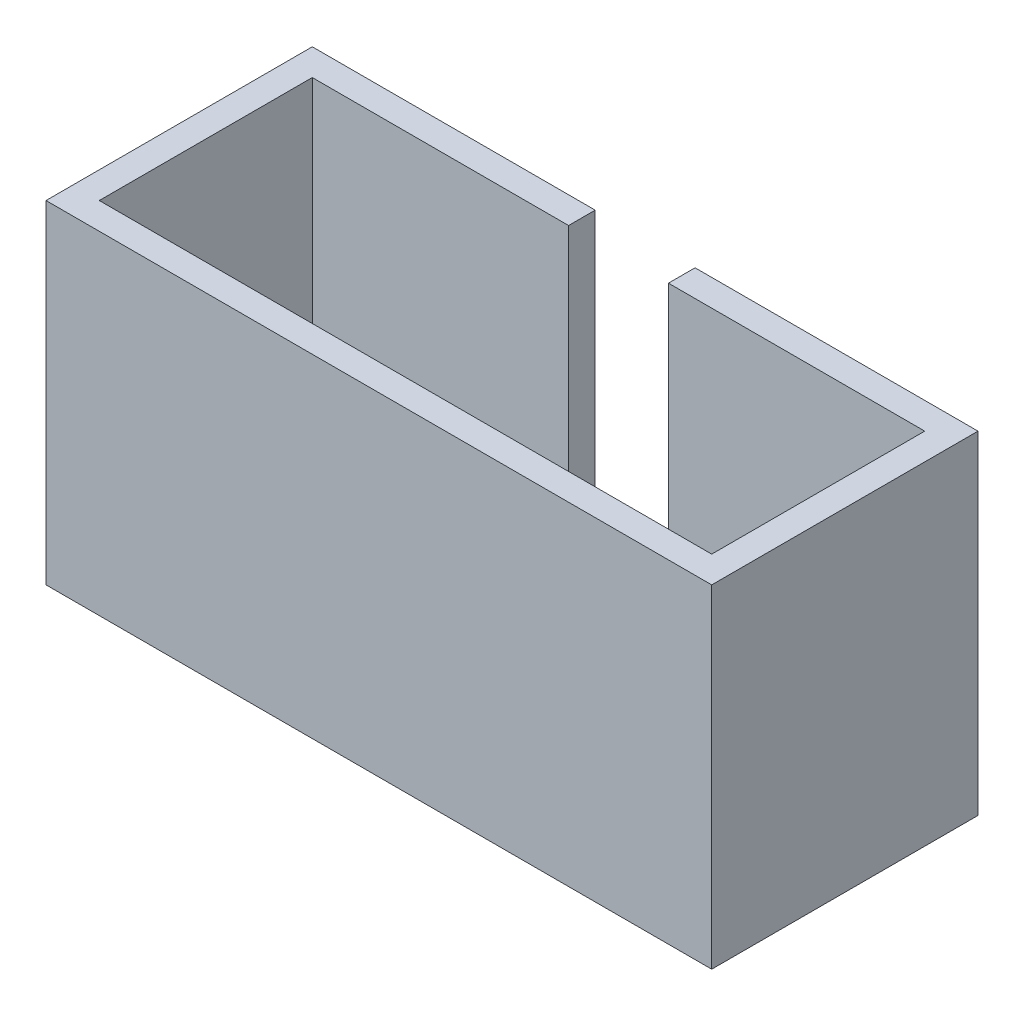
ISO-10303-21;
HEADER;
FILE_DESCRIPTION(('STEP AP214'),'2;1');
FILE_NAME('part.step','',(''),(''),'','','');
FILE_SCHEMA(('AUTOMOTIVE_DESIGN { 1 0 10303 214 1 1 1 1 }'));
ENDSEC;
DATA;
#1=APPLICATION_CONTEXT('core data for automotive mechanical design processes');
#2=APPLICATION_PROTOCOL_DEFINITION('international standard','automotive_design',2000,#1);
#3=PRODUCT_CONTEXT('',#1,'mechanical');
#4=PRODUCT('Part','Part','',(#3));
#5=PRODUCT_RELATED_PRODUCT_CATEGORY('part','',(#4));
#6=PRODUCT_DEFINITION_FORMATION('','',#4);
#7=PRODUCT_DEFINITION_CONTEXT('part definition',#1,'design');
#8=PRODUCT_DEFINITION('design','',#6,#7);
#9=PRODUCT_DEFINITION_SHAPE('','',#8);
#10=(LENGTH_UNIT() NAMED_UNIT(*) SI_UNIT(.MILLI.,.METRE.));
#11=(NAMED_UNIT(*) PLANE_ANGLE_UNIT() SI_UNIT($,.RADIAN.));
#12=(NAMED_UNIT(*) SI_UNIT($,.STERADIAN.) SOLID_ANGLE_UNIT());
#13=UNCERTAINTY_MEASURE_WITH_UNIT(LENGTH_MEASURE(1.E-05),#10,'distance_accuracy_value','');
#14=(GEOMETRIC_REPRESENTATION_CONTEXT(3) GLOBAL_UNCERTAINTY_ASSIGNED_CONTEXT((#13)) GLOBAL_UNIT_ASSIGNED_CONTEXT((#10,
#11,#12)) REPRESENTATION_CONTEXT('',''));
#15=CARTESIAN_POINT('',(0.,0.,0.));
#16=DIRECTION('',(0.,0.,1.));
#17=DIRECTION('',(1.,0.,0.));
#18=AXIS2_PLACEMENT_3D('',#15,#16,#17);
#19=CARTESIAN_POINT('',(0.,10.,0.));
#20=DIRECTION('',(0.,1.,0.));
#21=DIRECTION('',(0.,0.,1.));
#22=AXIS2_PLACEMENT_3D('',#19,#20,#21);
#23=PLANE('',#22);
#24=DIRECTION('',(-1.,0.,0.));
#25=VECTOR('',#24,1.);
#26=CARTESIAN_POINT('',(-10.,10.,-4.));
#27=LINE('',#26,#25);
#28=CARTESIAN_POINT('',(10.,10.,-4.));
#29=VERTEX_POINT('',#28);
#30=CARTESIAN_POINT('',(1.5,10.,-4.));
#31=VERTEX_POINT('',#30);
#32=EDGE_CURVE('E193',#29,#31,#27,.T.);
#33=ORIENTED_EDGE('',*,*,#32,.T.);
#34=DIRECTION('',(0.,0.,-1.));
#35=VECTOR('',#34,1.);
#36=CARTESIAN_POINT('',(1.5,10.,4.001));
#37=LINE('',#36,#35);
#38=CARTESIAN_POINT('',(1.5,10.,-3.2));
#39=VERTEX_POINT('',#38);
#40=EDGE_CURVE('E152',#39,#31,#37,.T.);
#41=ORIENTED_EDGE('',*,*,#40,.F.);
#42=DIRECTION('',(-1.,0.,0.));
#43=VECTOR('',#42,1.);
#44=CARTESIAN_POINT('',(-9.2,10.,-3.2));
#45=LINE('',#44,#43);
#46=CARTESIAN_POINT('',(9.2,10.,-3.2));
#47=VERTEX_POINT('',#46);
#48=EDGE_CURVE('E167',#47,#39,#45,.T.);
#49=ORIENTED_EDGE('',*,*,#48,.F.);
#50=DIRECTION('',(0.,0.,-1.));
#51=VECTOR('',#50,1.);
#52=CARTESIAN_POINT('',(9.2,10.,3.2));
#53=LINE('',#52,#51);
#54=CARTESIAN_POINT('',(9.2,10.,3.2));
#55=VERTEX_POINT('',#54);
#56=EDGE_CURVE('E164',#55,#47,#53,.T.);
#57=ORIENTED_EDGE('',*,*,#56,.F.);
#58=DIRECTION('',(1.,0.,0.));
#59=VECTOR('',#58,1.);
#60=CARTESIAN_POINT('',(-9.2,10.,3.2));
#61=LINE('',#60,#59);
#62=CARTESIAN_POINT('',(-9.2,10.,3.2));
#63=VERTEX_POINT('',#62);
#64=EDGE_CURVE('E172',#63,#55,#61,.T.);
#65=ORIENTED_EDGE('',*,*,#64,.F.);
#66=DIRECTION('',(0.,0.,1.));
#67=VECTOR('',#66,1.);
#68=CARTESIAN_POINT('',(-9.2,10.,3.2));
#69=LINE('',#68,#67);
#70=CARTESIAN_POINT('',(-9.2,10.,-3.2));
#71=VERTEX_POINT('',#70);
#72=EDGE_CURVE('E169',#71,#63,#69,.T.);
#73=ORIENTED_EDGE('',*,*,#72,.F.);
#74=CARTESIAN_POINT('',(-1.5,10.,-3.2));
#75=VERTEX_POINT('',#74);
#76=EDGE_CURVE('E166',#75,#71,#45,.T.);
#77=ORIENTED_EDGE('',*,*,#76,.F.);
#78=DIRECTION('',(0.,0.,-1.));
#79=VECTOR('',#78,1.);
#80=CARTESIAN_POINT('',(-1.5,10.,4.001));
#81=LINE('',#80,#79);
#82=CARTESIAN_POINT('',(-1.5,10.,-4.));
#83=VERTEX_POINT('',#82);
#84=EDGE_CURVE('E47',#75,#83,#81,.T.);
#85=ORIENTED_EDGE('',*,*,#84,.T.);
#86=CARTESIAN_POINT('',(-10.,10.,-4.));
#87=VERTEX_POINT('',#86);
#88=EDGE_CURVE('E192',#83,#87,#27,.T.);
#89=ORIENTED_EDGE('',*,*,#88,.T.);
#90=DIRECTION('',(0.,0.,1.));
#91=VECTOR('',#90,1.);
#92=CARTESIAN_POINT('',(-10.,10.,-4.));
#93=LINE('',#92,#91);
#94=CARTESIAN_POINT('',(-10.,10.,4.));
#95=VERTEX_POINT('',#94);
#96=EDGE_CURVE('E184',#87,#95,#93,.T.);
#97=ORIENTED_EDGE('',*,*,#96,.T.);
#98=DIRECTION('',(1.,0.,0.));
#99=VECTOR('',#98,1.);
#100=CARTESIAN_POINT('',(-10.,10.,4.));
#101=LINE('',#100,#99);
#102=CARTESIAN_POINT('',(10.,10.,4.));
#103=VERTEX_POINT('',#102);
#104=EDGE_CURVE('E187',#95,#103,#101,.T.);
#105=ORIENTED_EDGE('',*,*,#104,.T.);
#106=DIRECTION('',(0.,0.,-1.));
#107=VECTOR('',#106,1.);
#108=CARTESIAN_POINT('',(10.,10.,-4.));
#109=LINE('',#108,#107);
#110=EDGE_CURVE('E190',#103,#29,#109,.T.);
#111=ORIENTED_EDGE('',*,*,#110,.T.);
#112=EDGE_LOOP('',(#33,#41,#49,#57,#65,#73,#77,#85,#89,#97,#105,#111));
#113=FACE_BOUND('',#112,.T.);
#114=ADVANCED_FACE('F32',(#113),#23,.T.);
#115=CARTESIAN_POINT('',(-10.,10.,-4.));
#116=DIRECTION('',(0.,0.,1.));
#117=DIRECTION('',(1.,0.,0.));
#118=AXIS2_PLACEMENT_3D('',#115,#116,#117);
#119=PLANE('',#118);
#120=DIRECTION('',(0.,1.,0.));
#121=VECTOR('',#120,1.);
#122=CARTESIAN_POINT('',(1.5,2.,-4.));
#123=LINE('',#122,#121);
#124=CARTESIAN_POINT('',(1.5,2.,-4.));
#125=VERTEX_POINT('',#124);
#126=EDGE_CURVE('E147',#125,#31,#123,.T.);
#127=ORIENTED_EDGE('',*,*,#126,.T.);
#128=ORIENTED_EDGE('',*,*,#32,.F.);
#129=DIRECTION('',(0.,-1.,0.));
#130=VECTOR('',#129,1.);
#131=CARTESIAN_POINT('',(10.,10.,-4.));
#132=LINE('',#131,#130);
#133=CARTESIAN_POINT('',(10.,0.,-4.));
#134=VERTEX_POINT('',#133);
#135=EDGE_CURVE('E206',#29,#134,#132,.T.);
#136=ORIENTED_EDGE('',*,*,#135,.T.);
#137=DIRECTION('',(-1.,0.,0.));
#138=VECTOR('',#137,1.);
#139=CARTESIAN_POINT('',(-10.,0.,-4.));
#140=LINE('',#139,#138);
#141=CARTESIAN_POINT('',(-10.,0.,-4.));
#142=VERTEX_POINT('',#141);
#143=EDGE_CURVE('E188',#134,#142,#140,.T.);
#144=ORIENTED_EDGE('',*,*,#143,.T.);
#145=DIRECTION('',(0.,-1.,0.));
#146=VECTOR('',#145,1.);
#147=CARTESIAN_POINT('',(-10.,10.,-4.));
#148=LINE('',#147,#146);
#149=EDGE_CURVE('E196',#87,#142,#148,.T.);
#150=ORIENTED_EDGE('',*,*,#149,.F.);
#151=ORIENTED_EDGE('',*,*,#88,.F.);
#152=DIRECTION('',(0.,-1.,0.));
#153=VECTOR('',#152,1.);
#154=CARTESIAN_POINT('',(-1.5,2.,-4.));
#155=LINE('',#154,#153);
#156=CARTESIAN_POINT('',(-1.5,2.,-4.));
#157=VERTEX_POINT('',#156);
#158=EDGE_CURVE('E132',#83,#157,#155,.T.);
#159=ORIENTED_EDGE('',*,*,#158,.T.);
#160=DIRECTION('',(1.,0.,0.));
#161=VECTOR('',#160,1.);
#162=CARTESIAN_POINT('',(-1.5,2.,-4.));
#163=LINE('',#162,#161);
#164=EDGE_CURVE('E130',#157,#125,#163,.T.);
#165=ORIENTED_EDGE('',*,*,#164,.T.);
#166=EDGE_LOOP('',(#127,#128,#136,#144,#150,#151,#159,#165));
#167=FACE_BOUND('',#166,.T.);
#168=ADVANCED_FACE('F222',(#167),#119,.F.);
#169=CARTESIAN_POINT('',(-9.2,10.,-3.2));
#170=DIRECTION('',(0.,0.,1.));
#171=DIRECTION('',(1.,0.,0.));
#172=AXIS2_PLACEMENT_3D('',#169,#170,#171);
#173=PLANE('',#172);
#174=ORIENTED_EDGE('',*,*,#48,.T.);
#175=DIRECTION('',(0.,1.,0.));
#176=VECTOR('',#175,1.);
#177=CARTESIAN_POINT('',(1.5,2.,-3.2));
#178=LINE('',#177,#176);
#179=CARTESIAN_POINT('',(1.5,2.,-3.2));
#180=VERTEX_POINT('',#179);
#181=EDGE_CURVE('E142',#180,#39,#178,.T.);
#182=ORIENTED_EDGE('',*,*,#181,.F.);
#183=DIRECTION('',(1.,0.,0.));
#184=VECTOR('',#183,1.);
#185=CARTESIAN_POINT('',(-1.5,2.,-3.2));
#186=LINE('',#185,#184);
#187=CARTESIAN_POINT('',(-1.5,2.,-3.2));
#188=VERTEX_POINT('',#187);
#189=EDGE_CURVE('E127',#188,#180,#186,.T.);
#190=ORIENTED_EDGE('',*,*,#189,.F.);
#191=DIRECTION('',(0.,-1.,0.));
#192=VECTOR('',#191,1.);
#193=CARTESIAN_POINT('',(-1.5,2.,-3.2));
#194=LINE('',#193,#192);
#195=EDGE_CURVE('E134',#75,#188,#194,.T.);
#196=ORIENTED_EDGE('',*,*,#195,.F.);
#197=ORIENTED_EDGE('',*,*,#76,.T.);
#198=DIRECTION('',(0.,-1.,0.));
#199=VECTOR('',#198,1.);
#200=CARTESIAN_POINT('',(-9.2,10.,-3.2));
#201=LINE('',#200,#199);
#202=CARTESIAN_POINT('',(-9.2,0.8,-3.2));
#203=VERTEX_POINT('',#202);
#204=EDGE_CURVE('E179',#71,#203,#201,.T.);
#205=ORIENTED_EDGE('',*,*,#204,.T.);
#206=DIRECTION('',(-1.,0.,0.));
#207=VECTOR('',#206,1.);
#208=CARTESIAN_POINT('',(-9.2,0.8,-3.2));
#209=LINE('',#208,#207);
#210=CARTESIAN_POINT('',(9.2,0.8,-3.2));
#211=VERTEX_POINT('',#210);
#212=EDGE_CURVE('E55',#211,#203,#209,.T.);
#213=ORIENTED_EDGE('',*,*,#212,.F.);
#214=DIRECTION('',(0.,-1.,0.));
#215=VECTOR('',#214,1.);
#216=CARTESIAN_POINT('',(9.2,10.,-3.2));
#217=LINE('',#216,#215);
#218=EDGE_CURVE('E181',#47,#211,#217,.T.);
#219=ORIENTED_EDGE('',*,*,#218,.F.);
#220=EDGE_LOOP('',(#174,#182,#190,#196,#197,#205,#213,#219));
#221=FACE_BOUND('',#220,.T.);
#222=ADVANCED_FACE('F141',(#221),#173,.T.);
#223=CARTESIAN_POINT('',(0.,0.,0.));
#224=DIRECTION('',(0.,1.,0.));
#225=DIRECTION('',(0.,0.,1.));
#226=AXIS2_PLACEMENT_3D('',#223,#224,#225);
#227=PLANE('',#226);
#228=DIRECTION('',(0.,0.,1.));
#229=VECTOR('',#228,1.);
#230=CARTESIAN_POINT('',(-10.,0.,-4.));
#231=LINE('',#230,#229);
#232=CARTESIAN_POINT('',(-10.,0.,4.));
#233=VERTEX_POINT('',#232);
#234=EDGE_CURVE('E183',#142,#233,#231,.T.);
#235=ORIENTED_EDGE('',*,*,#234,.F.);
#236=ORIENTED_EDGE('',*,*,#143,.F.);
#237=DIRECTION('',(0.,0.,-1.));
#238=VECTOR('',#237,1.);
#239=CARTESIAN_POINT('',(10.,0.,-4.));
#240=LINE('',#239,#238);
#241=CARTESIAN_POINT('',(10.,0.,4.));
#242=VERTEX_POINT('',#241);
#243=EDGE_CURVE('E201',#242,#134,#240,.T.);
#244=ORIENTED_EDGE('',*,*,#243,.F.);
#245=DIRECTION('',(1.,0.,0.));
#246=VECTOR('',#245,1.);
#247=CARTESIAN_POINT('',(-10.,0.,4.));
#248=LINE('',#247,#246);
#249=EDGE_CURVE('E199',#233,#242,#248,.T.);
#250=ORIENTED_EDGE('',*,*,#249,.F.);
#251=EDGE_LOOP('',(#235,#236,#244,#250));
#252=FACE_BOUND('',#251,.T.);
#253=ADVANCED_FACE('F219',(#252),#227,.F.);
#254=CARTESIAN_POINT('',(-10.,10.,-4.));
#255=DIRECTION('',(1.,0.,0.));
#256=DIRECTION('',(0.,0.,-1.));
#257=AXIS2_PLACEMENT_3D('',#254,#255,#256);
#258=PLANE('',#257);
#259=ORIENTED_EDGE('',*,*,#234,.T.);
#260=DIRECTION('',(0.,-1.,0.));
#261=VECTOR('',#260,1.);
#262=CARTESIAN_POINT('',(-10.,10.,4.));
#263=LINE('',#262,#261);
#264=EDGE_CURVE('E11',#95,#233,#263,.T.);
#265=ORIENTED_EDGE('',*,*,#264,.F.);
#266=ORIENTED_EDGE('',*,*,#96,.F.);
#267=ORIENTED_EDGE('',*,*,#149,.T.);
#268=EDGE_LOOP('',(#259,#265,#266,#267));
#269=FACE_BOUND('',#268,.T.);
#270=ADVANCED_FACE('F34',(#269),#258,.F.);
#271=CARTESIAN_POINT('',(-10.,10.,4.));
#272=DIRECTION('',(0.,0.,-1.));
#273=DIRECTION('',(-1.,0.,0.));
#274=AXIS2_PLACEMENT_3D('',#271,#272,#273);
#275=PLANE('',#274);
#276=ORIENTED_EDGE('',*,*,#249,.T.);
#277=DIRECTION('',(0.,-1.,0.));
#278=VECTOR('',#277,1.);
#279=CARTESIAN_POINT('',(10.,10.,4.));
#280=LINE('',#279,#278);
#281=EDGE_CURVE('E40',#103,#242,#280,.T.);
#282=ORIENTED_EDGE('',*,*,#281,.F.);
#283=ORIENTED_EDGE('',*,*,#104,.F.);
#284=ORIENTED_EDGE('',*,*,#264,.T.);
#285=EDGE_LOOP('',(#276,#282,#283,#284));
#286=FACE_BOUND('',#285,.T.);
#287=ADVANCED_FACE('F266',(#286),#275,.F.);
#288=CARTESIAN_POINT('',(10.,10.,-4.));
#289=DIRECTION('',(-1.,0.,0.));
#290=DIRECTION('',(0.,0.,1.));
#291=AXIS2_PLACEMENT_3D('',#288,#289,#290);
#292=PLANE('',#291);
#293=ORIENTED_EDGE('',*,*,#243,.T.);
#294=ORIENTED_EDGE('',*,*,#135,.F.);
#295=ORIENTED_EDGE('',*,*,#110,.F.);
#296=ORIENTED_EDGE('',*,*,#281,.T.);
#297=EDGE_LOOP('',(#293,#294,#295,#296));
#298=FACE_BOUND('',#297,.T.);
#299=ADVANCED_FACE('F213',(#298),#292,.F.);
#300=CARTESIAN_POINT('',(9.2,10.,3.2));
#301=DIRECTION('',(-1.,0.,0.));
#302=DIRECTION('',(0.,0.,1.));
#303=AXIS2_PLACEMENT_3D('',#300,#301,#302);
#304=PLANE('',#303);
#305=DIRECTION('',(0.,0.,-1.));
#306=VECTOR('',#305,1.);
#307=CARTESIAN_POINT('',(9.2,0.8,-3.2));
#308=LINE('',#307,#306);
#309=CARTESIAN_POINT('',(9.2,0.8,3.2));
#310=VERTEX_POINT('',#309);
#311=EDGE_CURVE('E160',#310,#211,#308,.T.);
#312=ORIENTED_EDGE('',*,*,#311,.F.);
#313=DIRECTION('',(0.,-1.,0.));
#314=VECTOR('',#313,1.);
#315=CARTESIAN_POINT('',(9.2,10.,3.2));
#316=LINE('',#315,#314);
#317=EDGE_CURVE('E174',#55,#310,#316,.T.);
#318=ORIENTED_EDGE('',*,*,#317,.F.);
#319=ORIENTED_EDGE('',*,*,#56,.T.);
#320=ORIENTED_EDGE('',*,*,#218,.T.);
#321=EDGE_LOOP('',(#312,#318,#319,#320));
#322=FACE_BOUND('',#321,.T.);
#323=ADVANCED_FACE('F236',(#322),#304,.T.);
#324=CARTESIAN_POINT('',(-9.2,10.,3.2));
#325=DIRECTION('',(1.,0.,0.));
#326=DIRECTION('',(0.,0.,-1.));
#327=AXIS2_PLACEMENT_3D('',#324,#325,#326);
#328=PLANE('',#327);
#329=DIRECTION('',(0.,0.,1.));
#330=VECTOR('',#329,1.);
#331=CARTESIAN_POINT('',(-9.2,0.8,-3.2));
#332=LINE('',#331,#330);
#333=CARTESIAN_POINT('',(-9.2,0.8,3.2));
#334=VERTEX_POINT('',#333);
#335=EDGE_CURVE('E137',#203,#334,#332,.T.);
#336=ORIENTED_EDGE('',*,*,#335,.F.);
#337=ORIENTED_EDGE('',*,*,#204,.F.);
#338=ORIENTED_EDGE('',*,*,#72,.T.);
#339=DIRECTION('',(0.,-1.,0.));
#340=VECTOR('',#339,1.);
#341=CARTESIAN_POINT('',(-9.2,10.,3.2));
#342=LINE('',#341,#340);
#343=EDGE_CURVE('E176',#63,#334,#342,.T.);
#344=ORIENTED_EDGE('',*,*,#343,.T.);
#345=EDGE_LOOP('',(#336,#337,#338,#344));
#346=FACE_BOUND('',#345,.T.);
#347=ADVANCED_FACE('F243',(#346),#328,.T.);
#348=CARTESIAN_POINT('',(-9.2,10.,3.2));
#349=DIRECTION('',(0.,0.,-1.));
#350=DIRECTION('',(-1.,0.,0.));
#351=AXIS2_PLACEMENT_3D('',#348,#349,#350);
#352=PLANE('',#351);
#353=DIRECTION('',(1.,0.,0.));
#354=VECTOR('',#353,1.);
#355=CARTESIAN_POINT('',(-9.2,0.8,3.2));
#356=LINE('',#355,#354);
#357=EDGE_CURVE('E157',#334,#310,#356,.T.);
#358=ORIENTED_EDGE('',*,*,#357,.F.);
#359=ORIENTED_EDGE('',*,*,#343,.F.);
#360=ORIENTED_EDGE('',*,*,#64,.T.);
#361=ORIENTED_EDGE('',*,*,#317,.T.);
#362=EDGE_LOOP('',(#358,#359,#360,#361));
#363=FACE_BOUND('',#362,.T.);
#364=ADVANCED_FACE('F241',(#363),#352,.T.);
#365=CARTESIAN_POINT('',(0.,0.8,0.));
#366=DIRECTION('',(0.,1.,0.));
#367=DIRECTION('',(0.,0.,1.));
#368=AXIS2_PLACEMENT_3D('',#365,#366,#367);
#369=PLANE('',#368);
#370=ORIENTED_EDGE('',*,*,#335,.T.);
#371=ORIENTED_EDGE('',*,*,#357,.T.);
#372=ORIENTED_EDGE('',*,*,#311,.T.);
#373=ORIENTED_EDGE('',*,*,#212,.T.);
#374=EDGE_LOOP('',(#370,#371,#372,#373));
#375=FACE_BOUND('',#374,.T.);
#376=ADVANCED_FACE('F239',(#375),#369,.T.);
#377=CARTESIAN_POINT('',(-1.5,2.,4.001));
#378=DIRECTION('',(0.,1.,0.));
#379=DIRECTION('',(-1.,0.,0.));
#380=AXIS2_PLACEMENT_3D('',#377,#378,#379);
#381=PLANE('',#380);
#382=ORIENTED_EDGE('',*,*,#189,.T.);
#383=DIRECTION('',(0.,0.,-1.));
#384=VECTOR('',#383,1.);
#385=CARTESIAN_POINT('',(1.5,2.,4.001));
#386=LINE('',#385,#384);
#387=EDGE_CURVE('E138',#180,#125,#386,.T.);
#388=ORIENTED_EDGE('',*,*,#387,.T.);
#389=ORIENTED_EDGE('',*,*,#164,.F.);
#390=DIRECTION('',(0.,0.,-1.));
#391=VECTOR('',#390,1.);
#392=CARTESIAN_POINT('',(-1.5,2.,4.001));
#393=LINE('',#392,#391);
#394=EDGE_CURVE('E124',#188,#157,#393,.T.);
#395=ORIENTED_EDGE('',*,*,#394,.F.);
#396=EDGE_LOOP('',(#382,#388,#389,#395));
#397=FACE_BOUND('',#396,.T.);
#398=ADVANCED_FACE('F125',(#397),#381,.T.);
#399=CARTESIAN_POINT('',(1.5,2.,4.001));
#400=DIRECTION('',(-1.,0.,0.));
#401=DIRECTION('',(0.,0.,1.));
#402=AXIS2_PLACEMENT_3D('',#399,#400,#401);
#403=PLANE('',#402);
#404=ORIENTED_EDGE('',*,*,#181,.T.);
#405=ORIENTED_EDGE('',*,*,#40,.T.);
#406=ORIENTED_EDGE('',*,*,#126,.F.);
#407=ORIENTED_EDGE('',*,*,#387,.F.);
#408=EDGE_LOOP('',(#404,#405,#406,#407));
#409=FACE_BOUND('',#408,.T.);
#410=ADVANCED_FACE('F340',(#409),#403,.T.);
#411=CARTESIAN_POINT('',(-1.5,2.,4.001));
#412=DIRECTION('',(1.,0.,0.));
#413=DIRECTION('',(0.,0.,-1.));
#414=AXIS2_PLACEMENT_3D('',#411,#412,#413);
#415=PLANE('',#414);
#416=ORIENTED_EDGE('',*,*,#195,.T.);
#417=ORIENTED_EDGE('',*,*,#394,.T.);
#418=ORIENTED_EDGE('',*,*,#158,.F.);
#419=ORIENTED_EDGE('',*,*,#84,.F.);
#420=EDGE_LOOP('',(#416,#417,#418,#419));
#421=FACE_BOUND('',#420,.T.);
#422=ADVANCED_FACE('F135',(#421),#415,.T.);
#423=CLOSED_SHELL('',(#114,#168,#222,#253,#270,#287,#299,#323,#347,#364,#376,#398,#410,#422));
#424=MANIFOLD_SOLID_BREP('B2',#423);
#425=ADVANCED_BREP_SHAPE_REPRESENTATION('',(#18,#424),#14);
#426=SHAPE_DEFINITION_REPRESENTATION(#9,#425);
ENDSEC;
END-ISO-10303-21;
